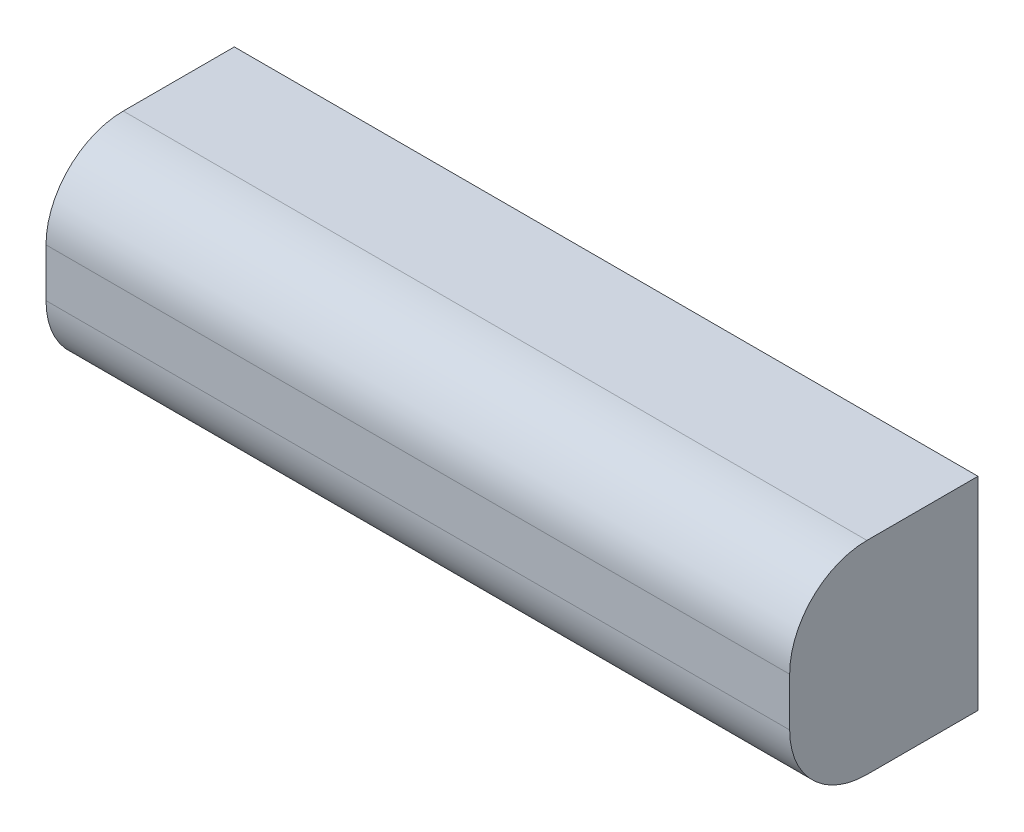
ISO-10303-21;
HEADER;
FILE_DESCRIPTION(('STEP AP214'),'2;1');
FILE_NAME('part.step','',(''),(''),'','','');
FILE_SCHEMA(('AUTOMOTIVE_DESIGN { 1 0 10303 214 1 1 1 1 }'));
ENDSEC;
DATA;
#1=APPLICATION_CONTEXT('core data for automotive mechanical design processes');
#2=APPLICATION_PROTOCOL_DEFINITION('international standard','automotive_design',2000,#1);
#3=PRODUCT_CONTEXT('',#1,'mechanical');
#4=PRODUCT('Part','Part','',(#3));
#5=PRODUCT_RELATED_PRODUCT_CATEGORY('part','',(#4));
#6=PRODUCT_DEFINITION_FORMATION('','',#4);
#7=PRODUCT_DEFINITION_CONTEXT('part definition',#1,'design');
#8=PRODUCT_DEFINITION('design','',#6,#7);
#9=PRODUCT_DEFINITION_SHAPE('','',#8);
#10=(LENGTH_UNIT() NAMED_UNIT(*) SI_UNIT(.MILLI.,.METRE.));
#11=(NAMED_UNIT(*) PLANE_ANGLE_UNIT() SI_UNIT($,.RADIAN.));
#12=(NAMED_UNIT(*) SI_UNIT($,.STERADIAN.) SOLID_ANGLE_UNIT());
#13=UNCERTAINTY_MEASURE_WITH_UNIT(LENGTH_MEASURE(1.E-05),#10,'distance_accuracy_value','');
#14=(GEOMETRIC_REPRESENTATION_CONTEXT(3) GLOBAL_UNCERTAINTY_ASSIGNED_CONTEXT((#13)) GLOBAL_UNIT_ASSIGNED_CONTEXT((#10,
#11,#12)) REPRESENTATION_CONTEXT('',''));
#15=CARTESIAN_POINT('',(0.,0.,0.));
#16=DIRECTION('',(0.,0.,1.));
#17=DIRECTION('',(1.,0.,0.));
#18=AXIS2_PLACEMENT_3D('',#15,#16,#17);
#19=CARTESIAN_POINT('',(38.5,-10.5,19.5));
#20=DIRECTION('',(-1.,0.,0.));
#21=DIRECTION('',(0.,0.,1.));
#22=AXIS2_PLACEMENT_3D('',#19,#20,#21);
#23=PLANE('',#22);
#24=DIRECTION('',(0.,0.,-1.));
#25=VECTOR('',#24,1.);
#26=CARTESIAN_POINT('',(38.5,10.5,19.5));
#27=LINE('',#26,#25);
#28=CARTESIAN_POINT('',(38.5,10.5,11.5));
#29=VERTEX_POINT('',#28);
#30=CARTESIAN_POINT('',(38.5,10.5,0.));
#31=VERTEX_POINT('',#30);
#32=EDGE_CURVE('E90',#29,#31,#27,.T.);
#33=ORIENTED_EDGE('',*,*,#32,.F.);
#34=CARTESIAN_POINT('',(38.5,2.5,11.5));
#35=DIRECTION('',(-1.,0.,0.));
#36=DIRECTION('',(0.,0.,1.));
#37=AXIS2_PLACEMENT_3D('',#34,#35,#36);
#38=CIRCLE('',#37,8.);
#39=CARTESIAN_POINT('',(38.5,2.5,19.5));
#40=VERTEX_POINT('',#39);
#41=EDGE_CURVE('E47',#29,#40,#38,.F.);
#42=ORIENTED_EDGE('',*,*,#41,.T.);
#43=DIRECTION('',(0.,1.,0.));
#44=VECTOR('',#43,1.);
#45=CARTESIAN_POINT('',(38.5,-10.5,19.5));
#46=LINE('',#45,#44);
#47=CARTESIAN_POINT('',(38.5,-2.5,19.5));
#48=VERTEX_POINT('',#47);
#49=EDGE_CURVE('E124',#48,#40,#46,.T.);
#50=ORIENTED_EDGE('',*,*,#49,.F.);
#51=CARTESIAN_POINT('',(38.5,-2.5,11.5));
#52=DIRECTION('',(-1.,0.,0.));
#53=DIRECTION('',(0.,0.,1.));
#54=AXIS2_PLACEMENT_3D('',#51,#52,#53);
#55=CIRCLE('',#54,8.);
#56=CARTESIAN_POINT('',(38.5,-10.5,11.5));
#57=VERTEX_POINT('',#56);
#58=EDGE_CURVE('E54',#48,#57,#55,.F.);
#59=ORIENTED_EDGE('',*,*,#58,.T.);
#60=DIRECTION('',(0.,0.,-1.));
#61=VECTOR('',#60,1.);
#62=CARTESIAN_POINT('',(38.5,-10.5,19.5));
#63=LINE('',#62,#61);
#64=CARTESIAN_POINT('',(38.5,-10.5,0.));
#65=VERTEX_POINT('',#64);
#66=EDGE_CURVE('E110',#57,#65,#63,.T.);
#67=ORIENTED_EDGE('',*,*,#66,.T.);
#68=DIRECTION('',(0.,1.,0.));
#69=VECTOR('',#68,1.);
#70=CARTESIAN_POINT('',(38.5,-10.5,0.));
#71=LINE('',#70,#69);
#72=EDGE_CURVE('E105',#65,#31,#71,.T.);
#73=ORIENTED_EDGE('',*,*,#72,.T.);
#74=EDGE_LOOP('',(#33,#42,#50,#59,#67,#73));
#75=FACE_BOUND('',#74,.T.);
#76=ADVANCED_FACE('F38',(#75),#23,.F.);
#77=CARTESIAN_POINT('',(-38.5,10.5,19.5));
#78=DIRECTION('',(0.,-1.,0.));
#79=DIRECTION('',(0.,0.,-1.));
#80=AXIS2_PLACEMENT_3D('',#77,#78,#79);
#81=PLANE('',#80);
#82=DIRECTION('',(0.,0.,-1.));
#83=VECTOR('',#82,1.);
#84=CARTESIAN_POINT('',(-38.5,10.5,19.5));
#85=LINE('',#84,#83);
#86=CARTESIAN_POINT('',(-38.5,10.5,11.5));
#87=VERTEX_POINT('',#86);
#88=CARTESIAN_POINT('',(-38.5,10.5,0.));
#89=VERTEX_POINT('',#88);
#90=EDGE_CURVE('E99',#87,#89,#85,.T.);
#91=ORIENTED_EDGE('',*,*,#90,.F.);
#92=DIRECTION('',(-1.,0.,0.));
#93=VECTOR('',#92,1.);
#94=CARTESIAN_POINT('',(-38.5,10.5,11.5));
#95=LINE('',#94,#93);
#96=EDGE_CURVE('E62',#87,#29,#95,.F.);
#97=ORIENTED_EDGE('',*,*,#96,.T.);
#98=ORIENTED_EDGE('',*,*,#32,.T.);
#99=DIRECTION('',(-1.,0.,0.));
#100=VECTOR('',#99,1.);
#101=CARTESIAN_POINT('',(-38.5,10.5,0.));
#102=LINE('',#101,#100);
#103=EDGE_CURVE('E93',#31,#89,#102,.T.);
#104=ORIENTED_EDGE('',*,*,#103,.T.);
#105=EDGE_LOOP('',(#91,#97,#98,#104));
#106=FACE_BOUND('',#105,.T.);
#107=ADVANCED_FACE('F92',(#106),#81,.F.);
#108=CARTESIAN_POINT('',(-38.5,-10.5,19.5));
#109=DIRECTION('',(1.,0.,0.));
#110=DIRECTION('',(0.,0.,-1.));
#111=AXIS2_PLACEMENT_3D('',#108,#109,#110);
#112=PLANE('',#111);
#113=DIRECTION('',(0.,-1.,0.));
#114=VECTOR('',#113,1.);
#115=CARTESIAN_POINT('',(-38.5,-10.5,19.5));
#116=LINE('',#115,#114);
#117=CARTESIAN_POINT('',(-38.5,2.5,19.5));
#118=VERTEX_POINT('',#117);
#119=CARTESIAN_POINT('',(-38.5,-2.5,19.5));
#120=VERTEX_POINT('',#119);
#121=EDGE_CURVE('E116',#118,#120,#116,.T.);
#122=ORIENTED_EDGE('',*,*,#121,.F.);
#123=CARTESIAN_POINT('',(-38.5,2.5,11.5));
#124=DIRECTION('',(1.,0.,0.));
#125=DIRECTION('',(0.,0.,-1.));
#126=AXIS2_PLACEMENT_3D('',#123,#124,#125);
#127=CIRCLE('',#126,8.);
#128=EDGE_CURVE('E141',#118,#87,#127,.F.);
#129=ORIENTED_EDGE('',*,*,#128,.T.);
#130=ORIENTED_EDGE('',*,*,#90,.T.);
#131=DIRECTION('',(0.,-1.,0.));
#132=VECTOR('',#131,1.);
#133=CARTESIAN_POINT('',(-38.5,-10.5,0.));
#134=LINE('',#133,#132);
#135=CARTESIAN_POINT('',(-38.5,-10.5,0.));
#136=VERTEX_POINT('',#135);
#137=EDGE_CURVE('E107',#89,#136,#134,.T.);
#138=ORIENTED_EDGE('',*,*,#137,.T.);
#139=DIRECTION('',(0.,0.,-1.));
#140=VECTOR('',#139,1.);
#141=CARTESIAN_POINT('',(-38.5,-10.5,19.5));
#142=LINE('',#141,#140);
#143=CARTESIAN_POINT('',(-38.5,-10.5,11.5));
#144=VERTEX_POINT('',#143);
#145=EDGE_CURVE('E127',#144,#136,#142,.T.);
#146=ORIENTED_EDGE('',*,*,#145,.F.);
#147=CARTESIAN_POINT('',(-38.5,-2.5,11.5));
#148=DIRECTION('',(1.,0.,0.));
#149=DIRECTION('',(0.,0.,-1.));
#150=AXIS2_PLACEMENT_3D('',#147,#148,#149);
#151=CIRCLE('',#150,8.);
#152=EDGE_CURVE('E138',#144,#120,#151,.F.);
#153=ORIENTED_EDGE('',*,*,#152,.T.);
#154=EDGE_LOOP('',(#122,#129,#130,#138,#146,#153));
#155=FACE_BOUND('',#154,.T.);
#156=ADVANCED_FACE('F159',(#155),#112,.F.);
#157=CARTESIAN_POINT('',(-38.5,-10.5,19.5));
#158=DIRECTION('',(0.,1.,0.));
#159=DIRECTION('',(0.,0.,1.));
#160=AXIS2_PLACEMENT_3D('',#157,#158,#159);
#161=PLANE('',#160);
#162=ORIENTED_EDGE('',*,*,#66,.F.);
#163=DIRECTION('',(1.,0.,0.));
#164=VECTOR('',#163,1.);
#165=CARTESIAN_POINT('',(-38.5,-10.5,11.5));
#166=LINE('',#165,#164);
#167=EDGE_CURVE('E11',#57,#144,#166,.F.);
#168=ORIENTED_EDGE('',*,*,#167,.T.);
#169=ORIENTED_EDGE('',*,*,#145,.T.);
#170=DIRECTION('',(1.,0.,0.));
#171=VECTOR('',#170,1.);
#172=CARTESIAN_POINT('',(-38.5,-10.5,0.));
#173=LINE('',#172,#171);
#174=EDGE_CURVE('E121',#136,#65,#173,.T.);
#175=ORIENTED_EDGE('',*,*,#174,.T.);
#176=EDGE_LOOP('',(#162,#168,#169,#175));
#177=FACE_BOUND('',#176,.T.);
#178=ADVANCED_FACE('F166',(#177),#161,.F.);
#179=CARTESIAN_POINT('',(0.,0.,19.5));
#180=DIRECTION('',(0.,0.,-1.));
#181=DIRECTION('',(-1.,0.,0.));
#182=AXIS2_PLACEMENT_3D('',#179,#180,#181);
#183=PLANE('',#182);
#184=ORIENTED_EDGE('',*,*,#49,.T.);
#185=DIRECTION('',(-1.,0.,0.));
#186=VECTOR('',#185,1.);
#187=CARTESIAN_POINT('',(0.,2.5,19.5));
#188=LINE('',#187,#186);
#189=EDGE_CURVE('E135',#40,#118,#188,.T.);
#190=ORIENTED_EDGE('',*,*,#189,.T.);
#191=ORIENTED_EDGE('',*,*,#121,.T.);
#192=DIRECTION('',(1.,0.,0.));
#193=VECTOR('',#192,1.);
#194=CARTESIAN_POINT('',(0.,-2.5,19.5));
#195=LINE('',#194,#193);
#196=EDGE_CURVE('E98',#120,#48,#195,.T.);
#197=ORIENTED_EDGE('',*,*,#196,.T.);
#198=EDGE_LOOP('',(#184,#190,#191,#197));
#199=FACE_BOUND('',#198,.T.);
#200=ADVANCED_FACE('F152',(#199),#183,.F.);
#201=CARTESIAN_POINT('',(0.,0.,0.));
#202=DIRECTION('',(0.,0.,-1.));
#203=DIRECTION('',(-1.,0.,0.));
#204=AXIS2_PLACEMENT_3D('',#201,#202,#203);
#205=PLANE('',#204);
#206=ORIENTED_EDGE('',*,*,#72,.F.);
#207=ORIENTED_EDGE('',*,*,#174,.F.);
#208=ORIENTED_EDGE('',*,*,#137,.F.);
#209=ORIENTED_EDGE('',*,*,#103,.F.);
#210=EDGE_LOOP('',(#206,#207,#208,#209));
#211=FACE_BOUND('',#210,.T.);
#212=ADVANCED_FACE('F103',(#211),#205,.T.);
#213=CARTESIAN_POINT('',(0.,2.5,11.5));
#214=DIRECTION('',(-1.,0.,0.));
#215=DIRECTION('',(0.,0.,1.));
#216=AXIS2_PLACEMENT_3D('',#213,#214,#215);
#217=CYLINDRICAL_SURFACE('',#216,8.);
#218=ORIENTED_EDGE('',*,*,#41,.F.);
#219=ORIENTED_EDGE('',*,*,#96,.F.);
#220=ORIENTED_EDGE('',*,*,#128,.F.);
#221=ORIENTED_EDGE('',*,*,#189,.F.);
#222=EDGE_LOOP('',(#218,#219,#220,#221));
#223=FACE_BOUND('',#222,.T.);
#224=ADVANCED_FACE('F157',(#223),#217,.T.);
#225=CARTESIAN_POINT('',(0.,-2.5,11.5));
#226=DIRECTION('',(1.,0.,0.));
#227=DIRECTION('',(0.,0.,-1.));
#228=AXIS2_PLACEMENT_3D('',#225,#226,#227);
#229=CYLINDRICAL_SURFACE('',#228,8.);
#230=ORIENTED_EDGE('',*,*,#152,.F.);
#231=ORIENTED_EDGE('',*,*,#167,.F.);
#232=ORIENTED_EDGE('',*,*,#58,.F.);
#233=ORIENTED_EDGE('',*,*,#196,.F.);
#234=EDGE_LOOP('',(#230,#231,#232,#233));
#235=FACE_BOUND('',#234,.T.);
#236=ADVANCED_FACE('F40',(#235),#229,.T.);
#237=CLOSED_SHELL('',(#76,#107,#156,#178,#200,#212,#224,#236));
#238=MANIFOLD_SOLID_BREP('B2',#237);
#239=ADVANCED_BREP_SHAPE_REPRESENTATION('',(#18,#238),#14);
#240=SHAPE_DEFINITION_REPRESENTATION(#9,#239);
ENDSEC;
END-ISO-10303-21;
